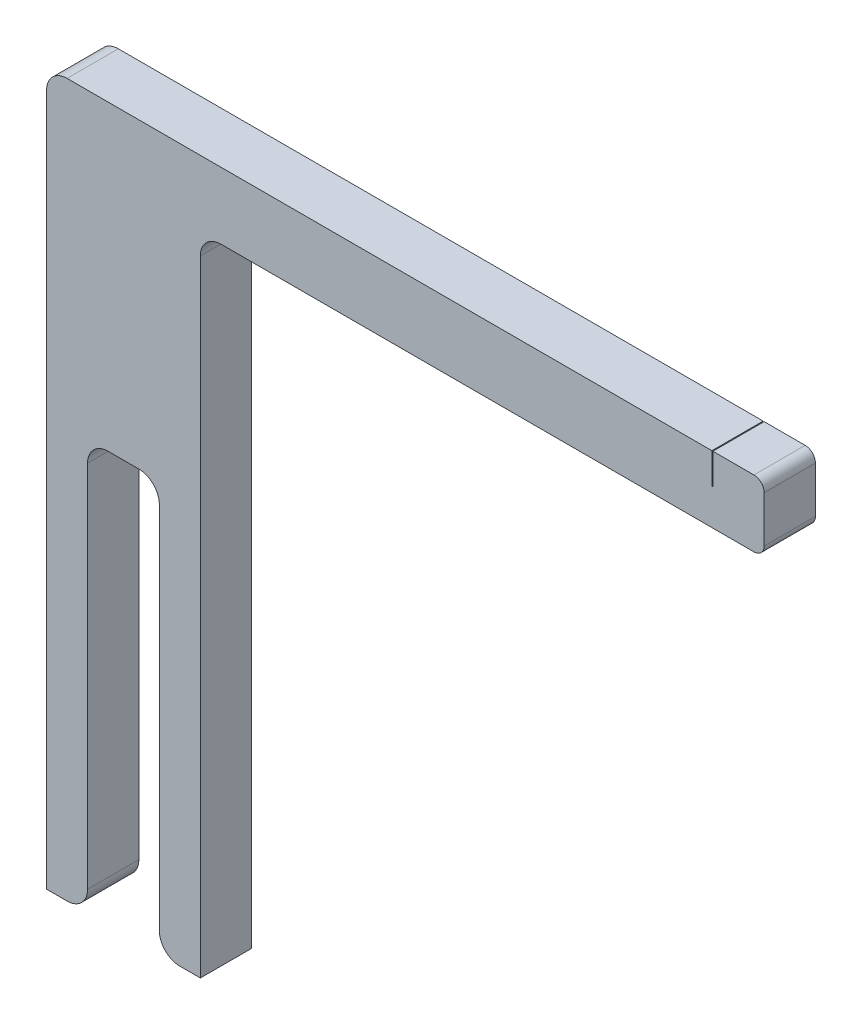
ISO-10303-21;
HEADER;
FILE_DESCRIPTION(('STEP AP214'),'2;1');
FILE_NAME('part.step','',(''),(''),'','','');
FILE_SCHEMA(('AUTOMOTIVE_DESIGN { 1 0 10303 214 1 1 1 1 }'));
ENDSEC;
DATA;
#1=APPLICATION_CONTEXT('core data for automotive mechanical design processes');
#2=APPLICATION_PROTOCOL_DEFINITION('international standard','automotive_design',2000,#1);
#3=PRODUCT_CONTEXT('',#1,'mechanical');
#4=PRODUCT('Part','Part','',(#3));
#5=PRODUCT_RELATED_PRODUCT_CATEGORY('part','',(#4));
#6=PRODUCT_DEFINITION_FORMATION('','',#4);
#7=PRODUCT_DEFINITION_CONTEXT('part definition',#1,'design');
#8=PRODUCT_DEFINITION('design','',#6,#7);
#9=PRODUCT_DEFINITION_SHAPE('','',#8);
#10=(LENGTH_UNIT() NAMED_UNIT(*) SI_UNIT(.MILLI.,.METRE.));
#11=(NAMED_UNIT(*) PLANE_ANGLE_UNIT() SI_UNIT($,.RADIAN.));
#12=(NAMED_UNIT(*) SI_UNIT($,.STERADIAN.) SOLID_ANGLE_UNIT());
#13=UNCERTAINTY_MEASURE_WITH_UNIT(LENGTH_MEASURE(1.E-05),#10,'distance_accuracy_value','');
#14=(GEOMETRIC_REPRESENTATION_CONTEXT(3) GLOBAL_UNCERTAINTY_ASSIGNED_CONTEXT((#13)) GLOBAL_UNIT_ASSIGNED_CONTEXT((#10,
#11,#12)) REPRESENTATION_CONTEXT('',''));
#15=CARTESIAN_POINT('',(0.,0.,0.));
#16=DIRECTION('',(0.,0.,1.));
#17=DIRECTION('',(1.,0.,0.));
#18=AXIS2_PLACEMENT_3D('',#15,#16,#17);
#19=CARTESIAN_POINT('',(2.,69.5,5.));
#20=DIRECTION('',(0.,-1.,0.));
#21=DIRECTION('',(0.,0.,-1.));
#22=AXIS2_PLACEMENT_3D('',#19,#20,#21);
#23=PLANE('',#22);
#24=DIRECTION('',(-1.,0.,0.));
#25=VECTOR('',#24,1.);
#26=CARTESIAN_POINT('',(2.,69.5,0.));
#27=LINE('',#26,#25);
#28=CARTESIAN_POINT('',(69.,69.5,0.));
#29=VERTEX_POINT('',#28);
#30=CARTESIAN_POINT('',(65.,69.5,0.));
#31=VERTEX_POINT('',#30);
#32=EDGE_CURVE('E276',#29,#31,#27,.T.);
#33=ORIENTED_EDGE('',*,*,#32,.T.);
#34=DIRECTION('',(0.,0.,-1.));
#35=VECTOR('',#34,1.);
#36=CARTESIAN_POINT('',(65.,69.5,5.));
#37=LINE('',#36,#35);
#38=CARTESIAN_POINT('',(65.,69.5,5.));
#39=VERTEX_POINT('',#38);
#40=EDGE_CURVE('E404',#39,#31,#37,.T.);
#41=ORIENTED_EDGE('',*,*,#40,.F.);
#42=DIRECTION('',(-1.,0.,0.));
#43=VECTOR('',#42,1.);
#44=CARTESIAN_POINT('',(2.,69.5,5.));
#45=LINE('',#44,#43);
#46=CARTESIAN_POINT('',(69.,69.5,5.));
#47=VERTEX_POINT('',#46);
#48=EDGE_CURVE('E243',#47,#39,#45,.T.);
#49=ORIENTED_EDGE('',*,*,#48,.F.);
#50=DIRECTION('',(0.,0.,-1.));
#51=VECTOR('',#50,1.);
#52=CARTESIAN_POINT('',(69.,69.5,5.));
#53=LINE('',#52,#51);
#54=EDGE_CURVE('E290',#47,#29,#53,.T.);
#55=ORIENTED_EDGE('',*,*,#54,.T.);
#56=EDGE_LOOP('',(#33,#41,#49,#55));
#57=FACE_BOUND('',#56,.T.);
#58=ADVANCED_FACE('F36',(#57),#23,.F.);
#59=CARTESIAN_POINT('',(4.,0.,5.));
#60=DIRECTION('',(0.,1.,0.));
#61=DIRECTION('',(-1.,0.,0.));
#62=AXIS2_PLACEMENT_3D('',#59,#60,#61);
#63=PLANE('',#62);
#64=DIRECTION('',(1.,0.,0.));
#65=VECTOR('',#64,1.);
#66=CARTESIAN_POINT('',(4.,0.,0.));
#67=LINE('',#66,#65);
#68=CARTESIAN_POINT('',(0.,0.,0.));
#69=VERTEX_POINT('',#68);
#70=CARTESIAN_POINT('',(2.,0.,0.));
#71=VERTEX_POINT('',#70);
#72=EDGE_CURVE('E251',#69,#71,#67,.T.);
#73=ORIENTED_EDGE('',*,*,#72,.T.);
#74=DIRECTION('',(0.,0.,-1.));
#75=VECTOR('',#74,1.);
#76=CARTESIAN_POINT('',(2.,0.,5.));
#77=LINE('',#76,#75);
#78=CARTESIAN_POINT('',(2.,0.,5.));
#79=VERTEX_POINT('',#78);
#80=EDGE_CURVE('E332',#71,#79,#77,.F.);
#81=ORIENTED_EDGE('',*,*,#80,.T.);
#82=DIRECTION('',(1.,0.,0.));
#83=VECTOR('',#82,1.);
#84=CARTESIAN_POINT('',(4.,0.,5.));
#85=LINE('',#84,#83);
#86=CARTESIAN_POINT('',(0.,0.,5.));
#87=VERTEX_POINT('',#86);
#88=EDGE_CURVE('E217',#87,#79,#85,.T.);
#89=ORIENTED_EDGE('',*,*,#88,.F.);
#90=DIRECTION('',(0.,0.,-1.));
#91=VECTOR('',#90,1.);
#92=CARTESIAN_POINT('',(0.,0.,5.));
#93=LINE('',#92,#91);
#94=EDGE_CURVE('E250',#87,#69,#93,.T.);
#95=ORIENTED_EDGE('',*,*,#94,.T.);
#96=EDGE_LOOP('',(#73,#81,#89,#95));
#97=FACE_BOUND('',#96,.T.);
#98=ADVANCED_FACE('F429',(#97),#63,.F.);
#99=CARTESIAN_POINT('',(4.,0.,5.));
#100=DIRECTION('',(-1.,0.,0.));
#101=DIRECTION('',(0.,0.,1.));
#102=AXIS2_PLACEMENT_3D('',#99,#100,#101);
#103=PLANE('',#102);
#104=DIRECTION('',(0.,1.,0.));
#105=VECTOR('',#104,1.);
#106=CARTESIAN_POINT('',(4.,0.,5.));
#107=LINE('',#106,#105);
#108=CARTESIAN_POINT('',(4.,2.,5.));
#109=VERTEX_POINT('',#108);
#110=CARTESIAN_POINT('',(4.,38.,5.));
#111=VERTEX_POINT('',#110);
#112=EDGE_CURVE('E220',#109,#111,#107,.T.);
#113=ORIENTED_EDGE('',*,*,#112,.F.);
#114=DIRECTION('',(0.,0.,-1.));
#115=VECTOR('',#114,1.);
#116=CARTESIAN_POINT('',(4.,2.,5.));
#117=LINE('',#116,#115);
#118=CARTESIAN_POINT('',(4.,2.,0.));
#119=VERTEX_POINT('',#118);
#120=EDGE_CURVE('E329',#109,#119,#117,.T.);
#121=ORIENTED_EDGE('',*,*,#120,.T.);
#122=DIRECTION('',(0.,1.,0.));
#123=VECTOR('',#122,1.);
#124=CARTESIAN_POINT('',(4.,0.,0.));
#125=LINE('',#124,#123);
#126=CARTESIAN_POINT('',(4.,38.,0.));
#127=VERTEX_POINT('',#126);
#128=EDGE_CURVE('E254',#119,#127,#125,.T.);
#129=ORIENTED_EDGE('',*,*,#128,.T.);
#130=DIRECTION('',(0.,0.,-1.));
#131=VECTOR('',#130,1.);
#132=CARTESIAN_POINT('',(4.,38.,5.));
#133=LINE('',#132,#131);
#134=EDGE_CURVE('E327',#127,#111,#133,.F.);
#135=ORIENTED_EDGE('',*,*,#134,.T.);
#136=EDGE_LOOP('',(#113,#121,#129,#135));
#137=FACE_BOUND('',#136,.T.);
#138=ADVANCED_FACE('F348',(#137),#103,.F.);
#139=CARTESIAN_POINT('',(4.,40.,5.));
#140=DIRECTION('',(0.,1.,0.));
#141=DIRECTION('',(0.,0.,1.));
#142=AXIS2_PLACEMENT_3D('',#139,#140,#141);
#143=PLANE('',#142);
#144=DIRECTION('',(1.,0.,0.));
#145=VECTOR('',#144,1.);
#146=CARTESIAN_POINT('',(4.,40.,0.));
#147=LINE('',#146,#145);
#148=CARTESIAN_POINT('',(6.,40.,0.));
#149=VERTEX_POINT('',#148);
#150=CARTESIAN_POINT('',(8.99999999999999,40.,0.));
#151=VERTEX_POINT('',#150);
#152=EDGE_CURVE('E257',#149,#151,#147,.T.);
#153=ORIENTED_EDGE('',*,*,#152,.T.);
#154=DIRECTION('',(0.,0.,-1.));
#155=VECTOR('',#154,1.);
#156=CARTESIAN_POINT('',(8.99999999999999,40.,5.));
#157=LINE('',#156,#155);
#158=CARTESIAN_POINT('',(8.99999999999999,40.,5.));
#159=VERTEX_POINT('',#158);
#160=EDGE_CURVE('E51',#151,#159,#157,.F.);
#161=ORIENTED_EDGE('',*,*,#160,.T.);
#162=DIRECTION('',(1.,0.,0.));
#163=VECTOR('',#162,1.);
#164=CARTESIAN_POINT('',(4.,40.,5.));
#165=LINE('',#164,#163);
#166=CARTESIAN_POINT('',(6.,40.,5.));
#167=VERTEX_POINT('',#166);
#168=EDGE_CURVE('E223',#167,#159,#165,.T.);
#169=ORIENTED_EDGE('',*,*,#168,.F.);
#170=DIRECTION('',(0.,0.,-1.));
#171=VECTOR('',#170,1.);
#172=CARTESIAN_POINT('',(6.,40.,0.));
#173=LINE('',#172,#171);
#174=EDGE_CURVE('E334',#167,#149,#173,.T.);
#175=ORIENTED_EDGE('',*,*,#174,.T.);
#176=EDGE_LOOP('',(#153,#161,#169,#175));
#177=FACE_BOUND('',#176,.T.);
#178=ADVANCED_FACE('F350',(#177),#143,.F.);
#179=CARTESIAN_POINT('',(11.,40.,5.));
#180=DIRECTION('',(1.,0.,0.));
#181=DIRECTION('',(0.,1.,0.));
#182=AXIS2_PLACEMENT_3D('',#179,#180,#181);
#183=PLANE('',#182);
#184=DIRECTION('',(0.,-1.,0.));
#185=VECTOR('',#184,1.);
#186=CARTESIAN_POINT('',(11.,40.,0.));
#187=LINE('',#186,#185);
#188=CARTESIAN_POINT('',(11.,38.,0.));
#189=VERTEX_POINT('',#188);
#190=CARTESIAN_POINT('',(11.,2.,0.));
#191=VERTEX_POINT('',#190);
#192=EDGE_CURVE('E259',#189,#191,#187,.T.);
#193=ORIENTED_EDGE('',*,*,#192,.T.);
#194=DIRECTION('',(0.,0.,-1.));
#195=VECTOR('',#194,1.);
#196=CARTESIAN_POINT('',(11.,2.,5.));
#197=LINE('',#196,#195);
#198=CARTESIAN_POINT('',(11.,2.,5.));
#199=VERTEX_POINT('',#198);
#200=EDGE_CURVE('E321',#191,#199,#197,.F.);
#201=ORIENTED_EDGE('',*,*,#200,.T.);
#202=DIRECTION('',(0.,-1.,0.));
#203=VECTOR('',#202,1.);
#204=CARTESIAN_POINT('',(11.,40.,5.));
#205=LINE('',#204,#203);
#206=CARTESIAN_POINT('',(11.,38.,5.));
#207=VERTEX_POINT('',#206);
#208=EDGE_CURVE('E225',#207,#199,#205,.T.);
#209=ORIENTED_EDGE('',*,*,#208,.F.);
#210=DIRECTION('',(0.,0.,-1.));
#211=VECTOR('',#210,1.);
#212=CARTESIAN_POINT('',(11.,38.,0.));
#213=LINE('',#212,#211);
#214=EDGE_CURVE('E318',#207,#189,#213,.T.);
#215=ORIENTED_EDGE('',*,*,#214,.T.);
#216=EDGE_LOOP('',(#193,#201,#209,#215));
#217=FACE_BOUND('',#216,.T.);
#218=ADVANCED_FACE('F359',(#217),#183,.F.);
#219=CARTESIAN_POINT('',(15.,0.,5.));
#220=DIRECTION('',(0.,1.,0.));
#221=DIRECTION('',(-1.,0.,0.));
#222=AXIS2_PLACEMENT_3D('',#219,#220,#221);
#223=PLANE('',#222);
#224=DIRECTION('',(1.,0.,0.));
#225=VECTOR('',#224,1.);
#226=CARTESIAN_POINT('',(15.,0.,5.));
#227=LINE('',#226,#225);
#228=CARTESIAN_POINT('',(13.,0.,5.));
#229=VERTEX_POINT('',#228);
#230=CARTESIAN_POINT('',(15.,0.,5.));
#231=VERTEX_POINT('',#230);
#232=EDGE_CURVE('E228',#229,#231,#227,.T.);
#233=ORIENTED_EDGE('',*,*,#232,.F.);
#234=DIRECTION('',(0.,0.,-1.));
#235=VECTOR('',#234,1.);
#236=CARTESIAN_POINT('',(13.,0.,5.));
#237=LINE('',#236,#235);
#238=CARTESIAN_POINT('',(13.,0.,0.));
#239=VERTEX_POINT('',#238);
#240=EDGE_CURVE('E311',#229,#239,#237,.T.);
#241=ORIENTED_EDGE('',*,*,#240,.T.);
#242=DIRECTION('',(1.,0.,0.));
#243=VECTOR('',#242,1.);
#244=CARTESIAN_POINT('',(15.,0.,0.));
#245=LINE('',#244,#243);
#246=CARTESIAN_POINT('',(15.,0.,0.));
#247=VERTEX_POINT('',#246);
#248=EDGE_CURVE('E262',#239,#247,#245,.T.);
#249=ORIENTED_EDGE('',*,*,#248,.T.);
#250=DIRECTION('',(0.,0.,-1.));
#251=VECTOR('',#250,1.);
#252=CARTESIAN_POINT('',(15.,0.,5.));
#253=LINE('',#252,#251);
#254=EDGE_CURVE('E308',#231,#247,#253,.T.);
#255=ORIENTED_EDGE('',*,*,#254,.F.);
#256=EDGE_LOOP('',(#233,#241,#249,#255));
#257=FACE_BOUND('',#256,.T.);
#258=ADVANCED_FACE('F368',(#257),#223,.F.);
#259=CARTESIAN_POINT('',(15.,61.,5.));
#260=DIRECTION('',(-1.,0.,0.));
#261=DIRECTION('',(0.,-1.,0.));
#262=AXIS2_PLACEMENT_3D('',#259,#260,#261);
#263=PLANE('',#262);
#264=DIRECTION('',(0.,1.,0.));
#265=VECTOR('',#264,1.);
#266=CARTESIAN_POINT('',(15.,61.,0.));
#267=LINE('',#266,#265);
#268=CARTESIAN_POINT('',(15.,61.,0.));
#269=VERTEX_POINT('',#268);
#270=EDGE_CURVE('E264',#247,#269,#267,.T.);
#271=ORIENTED_EDGE('',*,*,#270,.T.);
#272=DIRECTION('',(0.,0.,-1.));
#273=VECTOR('',#272,1.);
#274=CARTESIAN_POINT('',(15.,61.,5.));
#275=LINE('',#274,#273);
#276=CARTESIAN_POINT('',(15.,61.,5.));
#277=VERTEX_POINT('',#276);
#278=EDGE_CURVE('E305',#277,#269,#275,.T.);
#279=ORIENTED_EDGE('',*,*,#278,.F.);
#280=DIRECTION('',(0.,1.,0.));
#281=VECTOR('',#280,1.);
#282=CARTESIAN_POINT('',(15.,61.,5.));
#283=LINE('',#282,#281);
#284=EDGE_CURVE('E230',#231,#277,#283,.T.);
#285=ORIENTED_EDGE('',*,*,#284,.F.);
#286=ORIENTED_EDGE('',*,*,#254,.T.);
#287=EDGE_LOOP('',(#271,#279,#285,#286));
#288=FACE_BOUND('',#287,.T.);
#289=ADVANCED_FACE('F375',(#288),#263,.F.);
#290=CARTESIAN_POINT('',(17.,61.,5.));
#291=DIRECTION('',(0.,0.,-1.));
#292=DIRECTION('',(-1.,0.,0.));
#293=AXIS2_PLACEMENT_3D('',#290,#291,#292);
#294=CYLINDRICAL_SURFACE('',#293,2.);
#295=CARTESIAN_POINT('',(17.,61.,0.));
#296=DIRECTION('',(0.,0.,-1.));
#297=DIRECTION('',(1.,0.,0.));
#298=AXIS2_PLACEMENT_3D('',#295,#296,#297);
#299=CIRCLE('',#298,2.);
#300=CARTESIAN_POINT('',(17.,63.,0.));
#301=VERTEX_POINT('',#300);
#302=EDGE_CURVE('E266',#269,#301,#299,.T.);
#303=ORIENTED_EDGE('',*,*,#302,.T.);
#304=DIRECTION('',(0.,0.,-1.));
#305=VECTOR('',#304,1.);
#306=CARTESIAN_POINT('',(17.,63.,5.));
#307=LINE('',#306,#305);
#308=CARTESIAN_POINT('',(17.,63.,5.));
#309=VERTEX_POINT('',#308);
#310=EDGE_CURVE('E302',#309,#301,#307,.T.);
#311=ORIENTED_EDGE('',*,*,#310,.F.);
#312=CARTESIAN_POINT('',(17.,61.,5.));
#313=DIRECTION('',(0.,0.,-1.));
#314=DIRECTION('',(1.,0.,0.));
#315=AXIS2_PLACEMENT_3D('',#312,#313,#314);
#316=CIRCLE('',#315,2.);
#317=EDGE_CURVE('E232',#277,#309,#316,.T.);
#318=ORIENTED_EDGE('',*,*,#317,.F.);
#319=ORIENTED_EDGE('',*,*,#278,.T.);
#320=EDGE_LOOP('',(#303,#311,#318,#319));
#321=FACE_BOUND('',#320,.T.);
#322=ADVANCED_FACE('F378',(#321),#294,.F.);
#323=CARTESIAN_POINT('',(69.,63.,5.));
#324=DIRECTION('',(0.,1.,0.));
#325=DIRECTION('',(-1.,0.,0.));
#326=AXIS2_PLACEMENT_3D('',#323,#324,#325);
#327=PLANE('',#326);
#328=DIRECTION('',(1.,0.,0.));
#329=VECTOR('',#328,1.);
#330=CARTESIAN_POINT('',(69.,63.,0.));
#331=LINE('',#330,#329);
#332=CARTESIAN_POINT('',(69.,63.,0.));
#333=VERTEX_POINT('',#332);
#334=EDGE_CURVE('E268',#301,#333,#331,.T.);
#335=ORIENTED_EDGE('',*,*,#334,.T.);
#336=DIRECTION('',(0.,0.,-1.));
#337=VECTOR('',#336,1.);
#338=CARTESIAN_POINT('',(69.,63.,5.));
#339=LINE('',#338,#337);
#340=CARTESIAN_POINT('',(69.,63.,5.));
#341=VERTEX_POINT('',#340);
#342=EDGE_CURVE('E299',#341,#333,#339,.T.);
#343=ORIENTED_EDGE('',*,*,#342,.F.);
#344=DIRECTION('',(1.,0.,0.));
#345=VECTOR('',#344,1.);
#346=CARTESIAN_POINT('',(69.,63.,5.));
#347=LINE('',#346,#345);
#348=EDGE_CURVE('E234',#309,#341,#347,.T.);
#349=ORIENTED_EDGE('',*,*,#348,.F.);
#350=ORIENTED_EDGE('',*,*,#310,.T.);
#351=EDGE_LOOP('',(#335,#343,#349,#350));
#352=FACE_BOUND('',#351,.T.);
#353=ADVANCED_FACE('F383',(#352),#327,.F.);
#354=CARTESIAN_POINT('',(69.,64.,5.));
#355=DIRECTION('',(0.,0.,-1.));
#356=DIRECTION('',(-1.,0.,0.));
#357=AXIS2_PLACEMENT_3D('',#354,#355,#356);
#358=CYLINDRICAL_SURFACE('',#357,0.999999999999994);
#359=CARTESIAN_POINT('',(69.,64.,0.));
#360=DIRECTION('',(0.,0.,1.));
#361=DIRECTION('',(1.,0.,0.));
#362=AXIS2_PLACEMENT_3D('',#359,#360,#361);
#363=CIRCLE('',#362,0.999999999999994);
#364=CARTESIAN_POINT('',(70.,64.,0.));
#365=VERTEX_POINT('',#364);
#366=EDGE_CURVE('E270',#333,#365,#363,.T.);
#367=ORIENTED_EDGE('',*,*,#366,.T.);
#368=DIRECTION('',(0.,0.,-1.));
#369=VECTOR('',#368,1.);
#370=CARTESIAN_POINT('',(70.,64.,5.));
#371=LINE('',#370,#369);
#372=CARTESIAN_POINT('',(70.,64.,5.));
#373=VERTEX_POINT('',#372);
#374=EDGE_CURVE('E296',#373,#365,#371,.T.);
#375=ORIENTED_EDGE('',*,*,#374,.F.);
#376=CARTESIAN_POINT('',(69.,64.,5.));
#377=DIRECTION('',(0.,0.,1.));
#378=DIRECTION('',(1.,0.,0.));
#379=AXIS2_PLACEMENT_3D('',#376,#377,#378);
#380=CIRCLE('',#379,0.999999999999994);
#381=EDGE_CURVE('E236',#341,#373,#380,.T.);
#382=ORIENTED_EDGE('',*,*,#381,.F.);
#383=ORIENTED_EDGE('',*,*,#342,.T.);
#384=EDGE_LOOP('',(#367,#375,#382,#383));
#385=FACE_BOUND('',#384,.T.);
#386=ADVANCED_FACE('F389',(#385),#358,.T.);
#387=CARTESIAN_POINT('',(70.,68.5,5.));
#388=DIRECTION('',(-1.,0.,0.));
#389=DIRECTION('',(0.,0.,1.));
#390=AXIS2_PLACEMENT_3D('',#387,#388,#389);
#391=PLANE('',#390);
#392=DIRECTION('',(0.,1.,0.));
#393=VECTOR('',#392,1.);
#394=CARTESIAN_POINT('',(70.,68.5,0.));
#395=LINE('',#394,#393);
#396=CARTESIAN_POINT('',(70.,68.5,0.));
#397=VERTEX_POINT('',#396);
#398=EDGE_CURVE('E272',#365,#397,#395,.T.);
#399=ORIENTED_EDGE('',*,*,#398,.T.);
#400=DIRECTION('',(0.,0.,-1.));
#401=VECTOR('',#400,1.);
#402=CARTESIAN_POINT('',(70.,68.5,5.));
#403=LINE('',#402,#401);
#404=CARTESIAN_POINT('',(70.,68.5,5.));
#405=VERTEX_POINT('',#404);
#406=EDGE_CURVE('E293',#405,#397,#403,.T.);
#407=ORIENTED_EDGE('',*,*,#406,.F.);
#408=DIRECTION('',(0.,1.,0.));
#409=VECTOR('',#408,1.);
#410=CARTESIAN_POINT('',(70.,68.5,5.));
#411=LINE('',#410,#409);
#412=EDGE_CURVE('E238',#373,#405,#411,.T.);
#413=ORIENTED_EDGE('',*,*,#412,.F.);
#414=ORIENTED_EDGE('',*,*,#374,.T.);
#415=EDGE_LOOP('',(#399,#407,#413,#414));
#416=FACE_BOUND('',#415,.T.);
#417=ADVANCED_FACE('F393',(#416),#391,.F.);
#418=CARTESIAN_POINT('',(69.,68.5,5.));
#419=DIRECTION('',(0.,0.,-1.));
#420=DIRECTION('',(-1.,0.,0.));
#421=AXIS2_PLACEMENT_3D('',#418,#419,#420);
#422=CYLINDRICAL_SURFACE('',#421,1.);
#423=CARTESIAN_POINT('',(69.,68.5,0.));
#424=DIRECTION('',(0.,0.,1.));
#425=DIRECTION('',(1.,0.,0.));
#426=AXIS2_PLACEMENT_3D('',#423,#424,#425);
#427=CIRCLE('',#426,1.);
#428=EDGE_CURVE('E274',#397,#29,#427,.T.);
#429=ORIENTED_EDGE('',*,*,#428,.T.);
#430=ORIENTED_EDGE('',*,*,#54,.F.);
#431=CARTESIAN_POINT('',(69.,68.5,5.));
#432=DIRECTION('',(0.,0.,1.));
#433=DIRECTION('',(1.,0.,0.));
#434=AXIS2_PLACEMENT_3D('',#431,#432,#433);
#435=CIRCLE('',#434,1.);
#436=EDGE_CURVE('E240',#405,#47,#435,.T.);
#437=ORIENTED_EDGE('',*,*,#436,.F.);
#438=ORIENTED_EDGE('',*,*,#406,.T.);
#439=EDGE_LOOP('',(#429,#430,#437,#438));
#440=FACE_BOUND('',#439,.T.);
#441=ADVANCED_FACE('F398',(#440),#422,.T.);
#442=CARTESIAN_POINT('',(64.9,69.5,5.));
#443=VERTEX_POINT('',#442);
#444=CARTESIAN_POINT('',(2.,69.5,5.));
#445=VERTEX_POINT('',#444);
#446=EDGE_CURVE('E242',#443,#445,#45,.T.);
#447=ORIENTED_EDGE('',*,*,#446,.F.);
#448=DIRECTION('',(0.,0.,1.));
#449=VECTOR('',#448,1.);
#450=CARTESIAN_POINT('',(64.9,69.5,5.));
#451=LINE('',#450,#449);
#452=CARTESIAN_POINT('',(64.9,69.5,0.));
#453=VERTEX_POINT('',#452);
#454=EDGE_CURVE('E406',#453,#443,#451,.T.);
#455=ORIENTED_EDGE('',*,*,#454,.F.);
#456=CARTESIAN_POINT('',(2.,69.5,0.));
#457=VERTEX_POINT('',#456);
#458=EDGE_CURVE('E209',#453,#457,#27,.T.);
#459=ORIENTED_EDGE('',*,*,#458,.T.);
#460=DIRECTION('',(0.,0.,-1.));
#461=VECTOR('',#460,1.);
#462=CARTESIAN_POINT('',(2.,69.5,5.));
#463=LINE('',#462,#461);
#464=EDGE_CURVE('E287',#445,#457,#463,.T.);
#465=ORIENTED_EDGE('',*,*,#464,.F.);
#466=EDGE_LOOP('',(#447,#455,#459,#465));
#467=FACE_BOUND('',#466,.T.);
#468=ADVANCED_FACE('F415',(#467),#23,.F.);
#469=CARTESIAN_POINT('',(2.,67.5,5.));
#470=DIRECTION('',(0.,0.,-1.));
#471=DIRECTION('',(-1.,0.,0.));
#472=AXIS2_PLACEMENT_3D('',#469,#470,#471);
#473=CYLINDRICAL_SURFACE('',#472,2.);
#474=CARTESIAN_POINT('',(2.,67.5,0.));
#475=DIRECTION('',(0.,0.,1.));
#476=DIRECTION('',(1.,0.,0.));
#477=AXIS2_PLACEMENT_3D('',#474,#475,#476);
#478=CIRCLE('',#477,2.);
#479=CARTESIAN_POINT('',(0.,67.5,0.));
#480=VERTEX_POINT('',#479);
#481=EDGE_CURVE('E279',#457,#480,#478,.T.);
#482=ORIENTED_EDGE('',*,*,#481,.T.);
#483=DIRECTION('',(0.,0.,-1.));
#484=VECTOR('',#483,1.);
#485=CARTESIAN_POINT('',(0.,67.5,5.));
#486=LINE('',#485,#484);
#487=CARTESIAN_POINT('',(0.,67.5,5.));
#488=VERTEX_POINT('',#487);
#489=EDGE_CURVE('E284',#488,#480,#486,.T.);
#490=ORIENTED_EDGE('',*,*,#489,.F.);
#491=CARTESIAN_POINT('',(2.,67.5,5.));
#492=DIRECTION('',(0.,0.,1.));
#493=DIRECTION('',(1.,0.,0.));
#494=AXIS2_PLACEMENT_3D('',#491,#492,#493);
#495=CIRCLE('',#494,2.);
#496=EDGE_CURVE('E246',#445,#488,#495,.T.);
#497=ORIENTED_EDGE('',*,*,#496,.F.);
#498=ORIENTED_EDGE('',*,*,#464,.T.);
#499=EDGE_LOOP('',(#482,#490,#497,#498));
#500=FACE_BOUND('',#499,.T.);
#501=ADVANCED_FACE('F419',(#500),#473,.T.);
#502=CARTESIAN_POINT('',(0.,0.,5.));
#503=DIRECTION('',(1.,0.,0.));
#504=DIRECTION('',(0.,0.,-1.));
#505=AXIS2_PLACEMENT_3D('',#502,#503,#504);
#506=PLANE('',#505);
#507=DIRECTION('',(0.,-1.,0.));
#508=VECTOR('',#507,1.);
#509=CARTESIAN_POINT('',(0.,0.,0.));
#510=LINE('',#509,#508);
#511=EDGE_CURVE('E221',#480,#69,#510,.T.);
#512=ORIENTED_EDGE('',*,*,#511,.T.);
#513=ORIENTED_EDGE('',*,*,#94,.F.);
#514=DIRECTION('',(0.,-1.,0.));
#515=VECTOR('',#514,1.);
#516=CARTESIAN_POINT('',(0.,0.,5.));
#517=LINE('',#516,#515);
#518=EDGE_CURVE('E248',#488,#87,#517,.T.);
#519=ORIENTED_EDGE('',*,*,#518,.F.);
#520=ORIENTED_EDGE('',*,*,#489,.T.);
#521=EDGE_LOOP('',(#512,#513,#519,#520));
#522=FACE_BOUND('',#521,.T.);
#523=ADVANCED_FACE('F425',(#522),#506,.F.);
#524=CARTESIAN_POINT('',(2.,67.5,5.));
#525=DIRECTION('',(0.,0.,1.));
#526=DIRECTION('',(1.,0.,0.));
#527=AXIS2_PLACEMENT_3D('',#524,#525,#526);
#528=PLANE('',#527);
#529=ORIENTED_EDGE('',*,*,#208,.T.);
#530=CARTESIAN_POINT('',(13.,2.,5.));
#531=DIRECTION('',(0.,0.,1.));
#532=DIRECTION('',(1.,0.,0.));
#533=AXIS2_PLACEMENT_3D('',#530,#531,#532);
#534=CIRCLE('',#533,2.);
#535=EDGE_CURVE('E325',#199,#229,#534,.T.);
#536=ORIENTED_EDGE('',*,*,#535,.T.);
#537=ORIENTED_EDGE('',*,*,#232,.T.);
#538=ORIENTED_EDGE('',*,*,#284,.T.);
#539=ORIENTED_EDGE('',*,*,#317,.T.);
#540=ORIENTED_EDGE('',*,*,#348,.T.);
#541=ORIENTED_EDGE('',*,*,#381,.T.);
#542=ORIENTED_EDGE('',*,*,#412,.T.);
#543=ORIENTED_EDGE('',*,*,#436,.T.);
#544=ORIENTED_EDGE('',*,*,#48,.T.);
#545=DIRECTION('',(0.,1.,0.));
#546=VECTOR('',#545,1.);
#547=CARTESIAN_POINT('',(65.,66.5,5.));
#548=LINE('',#547,#546);
#549=CARTESIAN_POINT('',(65.,66.5,5.));
#550=VERTEX_POINT('',#549);
#551=EDGE_CURVE('E212',#550,#39,#548,.T.);
#552=ORIENTED_EDGE('',*,*,#551,.F.);
#553=DIRECTION('',(1.,0.,0.));
#554=VECTOR('',#553,1.);
#555=CARTESIAN_POINT('',(64.9,66.5,5.));
#556=LINE('',#555,#554);
#557=CARTESIAN_POINT('',(64.9,66.5,5.));
#558=VERTEX_POINT('',#557);
#559=EDGE_CURVE('E195',#558,#550,#556,.T.);
#560=ORIENTED_EDGE('',*,*,#559,.F.);
#561=DIRECTION('',(0.,1.,0.));
#562=VECTOR('',#561,1.);
#563=CARTESIAN_POINT('',(64.9,66.5,5.));
#564=LINE('',#563,#562);
#565=EDGE_CURVE('E191',#558,#443,#564,.T.);
#566=ORIENTED_EDGE('',*,*,#565,.T.);
#567=ORIENTED_EDGE('',*,*,#446,.T.);
#568=ORIENTED_EDGE('',*,*,#496,.T.);
#569=ORIENTED_EDGE('',*,*,#518,.T.);
#570=ORIENTED_EDGE('',*,*,#88,.T.);
#571=CARTESIAN_POINT('',(2.,2.,5.));
#572=DIRECTION('',(0.,0.,1.));
#573=DIRECTION('',(1.,0.,0.));
#574=AXIS2_PLACEMENT_3D('',#571,#572,#573);
#575=CIRCLE('',#574,2.);
#576=EDGE_CURVE('E323',#79,#109,#575,.T.);
#577=ORIENTED_EDGE('',*,*,#576,.T.);
#578=ORIENTED_EDGE('',*,*,#112,.T.);
#579=CARTESIAN_POINT('',(6.,38.,5.));
#580=DIRECTION('',(0.,0.,1.));
#581=DIRECTION('',(1.,0.,0.));
#582=AXIS2_PLACEMENT_3D('',#579,#580,#581);
#583=CIRCLE('',#582,2.);
#584=EDGE_CURVE('E12',#111,#167,#583,.F.);
#585=ORIENTED_EDGE('',*,*,#584,.T.);
#586=ORIENTED_EDGE('',*,*,#168,.T.);
#587=CARTESIAN_POINT('',(8.99999999999999,38.,5.));
#588=DIRECTION('',(0.,0.,1.));
#589=DIRECTION('',(1.,0.,0.));
#590=AXIS2_PLACEMENT_3D('',#587,#588,#589);
#591=CIRCLE('',#590,2.);
#592=EDGE_CURVE('E340',#159,#207,#591,.F.);
#593=ORIENTED_EDGE('',*,*,#592,.T.);
#594=EDGE_LOOP('',(#529,#536,#537,#538,#539,#540,#541,#542,#543,#544,#552,#560,#566,#567,#568,
#569,#570,#577,#578,#585,#586,#593));
#595=FACE_BOUND('',#594,.T.);
#596=ADVANCED_FACE('F352',(#595),#528,.T.);
#597=CARTESIAN_POINT('',(2.,67.5,0.));
#598=DIRECTION('',(0.,0.,1.));
#599=DIRECTION('',(1.,0.,0.));
#600=AXIS2_PLACEMENT_3D('',#597,#598,#599);
#601=PLANE('',#600);
#602=ORIENTED_EDGE('',*,*,#248,.F.);
#603=CARTESIAN_POINT('',(13.,2.,0.));
#604=DIRECTION('',(0.,0.,1.));
#605=DIRECTION('',(1.,0.,0.));
#606=AXIS2_PLACEMENT_3D('',#603,#604,#605);
#607=CIRCLE('',#606,2.);
#608=EDGE_CURVE('E316',#239,#191,#607,.F.);
#609=ORIENTED_EDGE('',*,*,#608,.T.);
#610=ORIENTED_EDGE('',*,*,#192,.F.);
#611=CARTESIAN_POINT('',(8.99999999999999,38.,0.));
#612=DIRECTION('',(0.,0.,1.));
#613=DIRECTION('',(1.,0.,0.));
#614=AXIS2_PLACEMENT_3D('',#611,#612,#613);
#615=CIRCLE('',#614,2.);
#616=EDGE_CURVE('E338',#189,#151,#615,.T.);
#617=ORIENTED_EDGE('',*,*,#616,.T.);
#618=ORIENTED_EDGE('',*,*,#152,.F.);
#619=CARTESIAN_POINT('',(6.,38.,0.));
#620=DIRECTION('',(0.,0.,1.));
#621=DIRECTION('',(1.,0.,0.));
#622=AXIS2_PLACEMENT_3D('',#619,#620,#621);
#623=CIRCLE('',#622,2.);
#624=EDGE_CURVE('E44',#149,#127,#623,.T.);
#625=ORIENTED_EDGE('',*,*,#624,.T.);
#626=ORIENTED_EDGE('',*,*,#128,.F.);
#627=CARTESIAN_POINT('',(2.,2.,0.));
#628=DIRECTION('',(0.,0.,1.));
#629=DIRECTION('',(1.,0.,0.));
#630=AXIS2_PLACEMENT_3D('',#627,#628,#629);
#631=CIRCLE('',#630,2.);
#632=EDGE_CURVE('E314',#119,#71,#631,.F.);
#633=ORIENTED_EDGE('',*,*,#632,.T.);
#634=ORIENTED_EDGE('',*,*,#72,.F.);
#635=ORIENTED_EDGE('',*,*,#511,.F.);
#636=ORIENTED_EDGE('',*,*,#481,.F.);
#637=ORIENTED_EDGE('',*,*,#458,.F.);
#638=DIRECTION('',(0.,1.,0.));
#639=VECTOR('',#638,1.);
#640=CARTESIAN_POINT('',(64.9,66.5,0.));
#641=LINE('',#640,#639);
#642=CARTESIAN_POINT('',(64.9,66.5,0.));
#643=VERTEX_POINT('',#642);
#644=EDGE_CURVE('E188',#643,#453,#641,.T.);
#645=ORIENTED_EDGE('',*,*,#644,.F.);
#646=DIRECTION('',(-1.,0.,0.));
#647=VECTOR('',#646,1.);
#648=CARTESIAN_POINT('',(64.9,66.5,0.));
#649=LINE('',#648,#647);
#650=CARTESIAN_POINT('',(65.,66.5,0.));
#651=VERTEX_POINT('',#650);
#652=EDGE_CURVE('E196',#651,#643,#649,.T.);
#653=ORIENTED_EDGE('',*,*,#652,.F.);
#654=DIRECTION('',(0.,1.,0.));
#655=VECTOR('',#654,1.);
#656=CARTESIAN_POINT('',(65.,66.5,0.));
#657=LINE('',#656,#655);
#658=EDGE_CURVE('E210',#651,#31,#657,.T.);
#659=ORIENTED_EDGE('',*,*,#658,.T.);
#660=ORIENTED_EDGE('',*,*,#32,.F.);
#661=ORIENTED_EDGE('',*,*,#428,.F.);
#662=ORIENTED_EDGE('',*,*,#398,.F.);
#663=ORIENTED_EDGE('',*,*,#366,.F.);
#664=ORIENTED_EDGE('',*,*,#334,.F.);
#665=ORIENTED_EDGE('',*,*,#302,.F.);
#666=ORIENTED_EDGE('',*,*,#270,.F.);
#667=EDGE_LOOP('',(#602,#609,#610,#617,#618,#625,#626,#633,#634,#635,#636,#637,#645,#653,#659,
#660,#661,#662,#663,#664,#665,#666));
#668=FACE_BOUND('',#667,.T.);
#669=ADVANCED_FACE('F207',(#668),#601,.F.);
#670=CARTESIAN_POINT('',(65.,66.5,5.));
#671=DIRECTION('',(1.,0.,0.));
#672=DIRECTION('',(0.,0.,-1.));
#673=AXIS2_PLACEMENT_3D('',#670,#671,#672);
#674=PLANE('',#673);
#675=ORIENTED_EDGE('',*,*,#40,.T.);
#676=ORIENTED_EDGE('',*,*,#658,.F.);
#677=DIRECTION('',(0.,0.,-1.));
#678=VECTOR('',#677,1.);
#679=CARTESIAN_POINT('',(65.,66.5,5.));
#680=LINE('',#679,#678);
#681=EDGE_CURVE('E200',#550,#651,#680,.T.);
#682=ORIENTED_EDGE('',*,*,#681,.F.);
#683=ORIENTED_EDGE('',*,*,#551,.T.);
#684=EDGE_LOOP('',(#675,#676,#682,#683));
#685=FACE_BOUND('',#684,.T.);
#686=ADVANCED_FACE('F410',(#685),#674,.F.);
#687=CARTESIAN_POINT('',(64.9,66.5,5.));
#688=DIRECTION('',(-1.,0.,0.));
#689=DIRECTION('',(0.,0.,1.));
#690=AXIS2_PLACEMENT_3D('',#687,#688,#689);
#691=PLANE('',#690);
#692=ORIENTED_EDGE('',*,*,#454,.T.);
#693=ORIENTED_EDGE('',*,*,#565,.F.);
#694=DIRECTION('',(0.,0.,1.));
#695=VECTOR('',#694,1.);
#696=CARTESIAN_POINT('',(64.9,66.5,5.));
#697=LINE('',#696,#695);
#698=EDGE_CURVE('E184',#643,#558,#697,.T.);
#699=ORIENTED_EDGE('',*,*,#698,.F.);
#700=ORIENTED_EDGE('',*,*,#644,.T.);
#701=EDGE_LOOP('',(#692,#693,#699,#700));
#702=FACE_BOUND('',#701,.T.);
#703=ADVANCED_FACE('F186',(#702),#691,.F.);
#704=CARTESIAN_POINT('',(0.,66.5,0.));
#705=DIRECTION('',(0.,-1.,0.));
#706=DIRECTION('',(0.,0.,-1.));
#707=AXIS2_PLACEMENT_3D('',#704,#705,#706);
#708=PLANE('',#707);
#709=ORIENTED_EDGE('',*,*,#681,.T.);
#710=ORIENTED_EDGE('',*,*,#652,.T.);
#711=ORIENTED_EDGE('',*,*,#698,.T.);
#712=ORIENTED_EDGE('',*,*,#559,.T.);
#713=EDGE_LOOP('',(#709,#710,#711,#712));
#714=FACE_BOUND('',#713,.T.);
#715=ADVANCED_FACE('F199',(#714),#708,.F.);
#716=CARTESIAN_POINT('',(13.,2.,5.));
#717=DIRECTION('',(0.,0.,-1.));
#718=DIRECTION('',(-1.,0.,0.));
#719=AXIS2_PLACEMENT_3D('',#716,#717,#718);
#720=CYLINDRICAL_SURFACE('',#719,2.);
#721=ORIENTED_EDGE('',*,*,#535,.F.);
#722=ORIENTED_EDGE('',*,*,#200,.F.);
#723=ORIENTED_EDGE('',*,*,#608,.F.);
#724=ORIENTED_EDGE('',*,*,#240,.F.);
#725=EDGE_LOOP('',(#721,#722,#723,#724));
#726=FACE_BOUND('',#725,.T.);
#727=ADVANCED_FACE('F365',(#726),#720,.T.);
#728=CARTESIAN_POINT('',(2.,2.,5.));
#729=DIRECTION('',(0.,0.,-1.));
#730=DIRECTION('',(-1.,0.,0.));
#731=AXIS2_PLACEMENT_3D('',#728,#729,#730);
#732=CYLINDRICAL_SURFACE('',#731,2.);
#733=ORIENTED_EDGE('',*,*,#576,.F.);
#734=ORIENTED_EDGE('',*,*,#80,.F.);
#735=ORIENTED_EDGE('',*,*,#632,.F.);
#736=ORIENTED_EDGE('',*,*,#120,.F.);
#737=EDGE_LOOP('',(#733,#734,#735,#736));
#738=FACE_BOUND('',#737,.T.);
#739=ADVANCED_FACE('F432',(#738),#732,.T.);
#740=CARTESIAN_POINT('',(8.99999999999999,38.,5.));
#741=DIRECTION('',(0.,0.,1.));
#742=DIRECTION('',(1.,0.,0.));
#743=AXIS2_PLACEMENT_3D('',#740,#741,#742);
#744=CYLINDRICAL_SURFACE('',#743,2.);
#745=ORIENTED_EDGE('',*,*,#592,.F.);
#746=ORIENTED_EDGE('',*,*,#160,.F.);
#747=ORIENTED_EDGE('',*,*,#616,.F.);
#748=ORIENTED_EDGE('',*,*,#214,.F.);
#749=EDGE_LOOP('',(#745,#746,#747,#748));
#750=FACE_BOUND('',#749,.T.);
#751=ADVANCED_FACE('F356',(#750),#744,.F.);
#752=CARTESIAN_POINT('',(6.,38.,5.));
#753=DIRECTION('',(0.,0.,1.));
#754=DIRECTION('',(1.,0.,0.));
#755=AXIS2_PLACEMENT_3D('',#752,#753,#754);
#756=CYLINDRICAL_SURFACE('',#755,2.);
#757=ORIENTED_EDGE('',*,*,#584,.F.);
#758=ORIENTED_EDGE('',*,*,#134,.F.);
#759=ORIENTED_EDGE('',*,*,#624,.F.);
#760=ORIENTED_EDGE('',*,*,#174,.F.);
#761=EDGE_LOOP('',(#757,#758,#759,#760));
#762=FACE_BOUND('',#761,.T.);
#763=ADVANCED_FACE('F38',(#762),#756,.F.);
#764=CLOSED_SHELL('',(#58,#98,#138,#178,#218,#258,#289,#322,#353,#386,#417,#441,#468,#501,#523,
#596,#669,#686,#703,#715,#727,#739,#751,#763));
#765=MANIFOLD_SOLID_BREP('B2',#764);
#766=ADVANCED_BREP_SHAPE_REPRESENTATION('',(#18,#765),#14);
#767=SHAPE_DEFINITION_REPRESENTATION(#9,#766);
ENDSEC;
END-ISO-10303-21;
